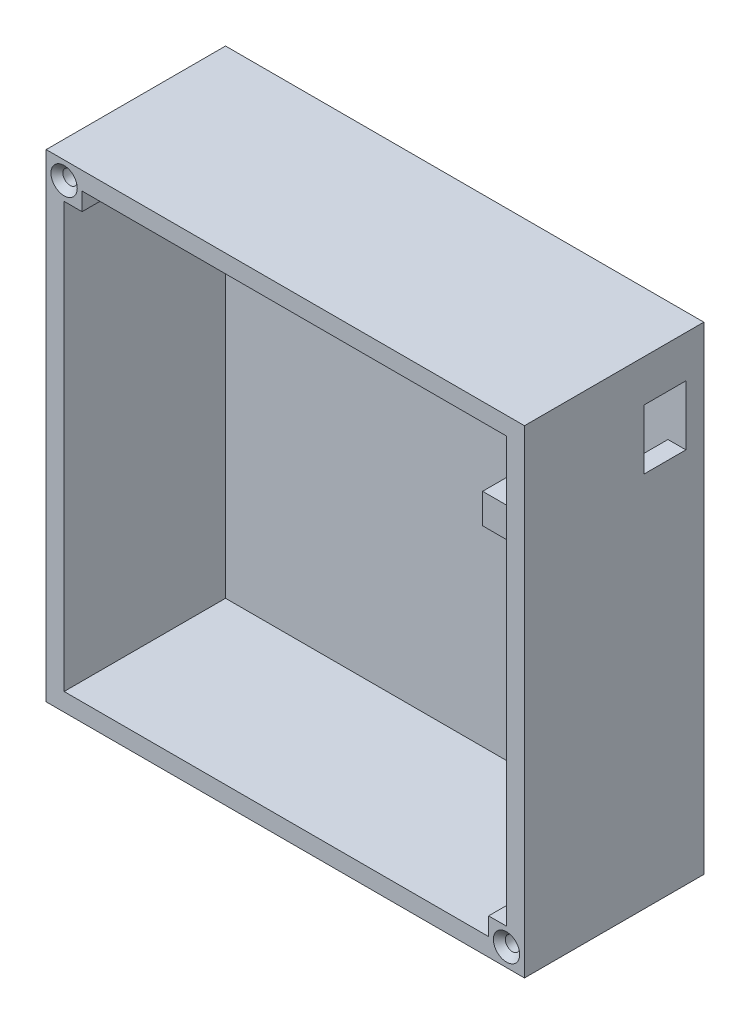
ISO-10303-21;
HEADER;
FILE_DESCRIPTION(('STEP AP214'),'2;1');
FILE_NAME('part.step','',(''),(''),'','','');
FILE_SCHEMA(('AUTOMOTIVE_DESIGN { 1 0 10303 214 1 1 1 1 }'));
ENDSEC;
DATA;
#1=APPLICATION_CONTEXT('core data for automotive mechanical design processes');
#2=APPLICATION_PROTOCOL_DEFINITION('international standard','automotive_design',2000,#1);
#3=PRODUCT_CONTEXT('',#1,'mechanical');
#4=PRODUCT('Part','Part','',(#3));
#5=PRODUCT_RELATED_PRODUCT_CATEGORY('part','',(#4));
#6=PRODUCT_DEFINITION_FORMATION('','',#4);
#7=PRODUCT_DEFINITION_CONTEXT('part definition',#1,'design');
#8=PRODUCT_DEFINITION('design','',#6,#7);
#9=PRODUCT_DEFINITION_SHAPE('','',#8);
#10=(LENGTH_UNIT() NAMED_UNIT(*) SI_UNIT(.MILLI.,.METRE.));
#11=(NAMED_UNIT(*) PLANE_ANGLE_UNIT() SI_UNIT($,.RADIAN.));
#12=(NAMED_UNIT(*) SI_UNIT($,.STERADIAN.) SOLID_ANGLE_UNIT());
#13=UNCERTAINTY_MEASURE_WITH_UNIT(LENGTH_MEASURE(1.E-05),#10,'distance_accuracy_value','');
#14=(GEOMETRIC_REPRESENTATION_CONTEXT(3) GLOBAL_UNCERTAINTY_ASSIGNED_CONTEXT((#13)) GLOBAL_UNIT_ASSIGNED_CONTEXT((#10,
#11,#12)) REPRESENTATION_CONTEXT('',''));
#15=CARTESIAN_POINT('',(0.,0.,0.));
#16=DIRECTION('',(0.,0.,1.));
#17=DIRECTION('',(1.,0.,0.));
#18=AXIS2_PLACEMENT_3D('',#15,#16,#17);
#19=CARTESIAN_POINT('',(0.,0.,3.));
#20=DIRECTION('',(0.,0.,1.));
#21=DIRECTION('',(1.,0.,0.));
#22=AXIS2_PLACEMENT_3D('',#19,#20,#21);
#23=PLANE('',#22);
#24=DIRECTION('',(0.,-1.,0.));
#25=VECTOR('',#24,1.);
#26=CARTESIAN_POINT('',(74.,3.,3.));
#27=LINE('',#26,#25);
#28=CARTESIAN_POINT('',(74.,6.,3.));
#29=VERTEX_POINT('',#28);
#30=CARTESIAN_POINT('',(74.,3.,3.));
#31=VERTEX_POINT('',#30);
#32=EDGE_CURVE('E310',#29,#31,#27,.T.);
#33=ORIENTED_EDGE('',*,*,#32,.F.);
#34=DIRECTION('',(-1.,0.,0.));
#35=VECTOR('',#34,1.);
#36=CARTESIAN_POINT('',(77.,6.,3.));
#37=LINE('',#36,#35);
#38=CARTESIAN_POINT('',(77.,5.99999999999999,3.));
#39=VERTEX_POINT('',#38);
#40=EDGE_CURVE('E305',#39,#29,#37,.T.);
#41=ORIENTED_EDGE('',*,*,#40,.F.);
#42=DIRECTION('',(0.,1.,0.));
#43=VECTOR('',#42,1.);
#44=CARTESIAN_POINT('',(77.,77.,3.));
#45=LINE('',#44,#43);
#46=CARTESIAN_POINT('',(77.,63.,3.));
#47=VERTEX_POINT('',#46);
#48=EDGE_CURVE('E404',#39,#47,#45,.T.);
#49=ORIENTED_EDGE('',*,*,#48,.T.);
#50=DIRECTION('',(1.,0.,0.));
#51=VECTOR('',#50,1.);
#52=CARTESIAN_POINT('',(77.,63.,3.));
#53=LINE('',#52,#51);
#54=CARTESIAN_POINT('',(80.,63.,3.));
#55=VERTEX_POINT('',#54);
#56=EDGE_CURVE('E383',#47,#55,#53,.T.);
#57=ORIENTED_EDGE('',*,*,#56,.T.);
#58=DIRECTION('',(0.,1.,0.));
#59=VECTOR('',#58,1.);
#60=CARTESIAN_POINT('',(80.,68.,3.));
#61=LINE('',#60,#59);
#62=CARTESIAN_POINT('',(80.,73.,3.));
#63=VERTEX_POINT('',#62);
#64=EDGE_CURVE('E360',#55,#63,#61,.T.);
#65=ORIENTED_EDGE('',*,*,#64,.T.);
#66=DIRECTION('',(1.,0.,0.));
#67=VECTOR('',#66,1.);
#68=CARTESIAN_POINT('',(77.,73.,3.));
#69=LINE('',#68,#67);
#70=CARTESIAN_POINT('',(77.,73.,3.));
#71=VERTEX_POINT('',#70);
#72=EDGE_CURVE('E368',#71,#63,#69,.T.);
#73=ORIENTED_EDGE('',*,*,#72,.F.);
#74=CARTESIAN_POINT('',(77.,77.,3.));
#75=VERTEX_POINT('',#74);
#76=EDGE_CURVE('E403',#71,#75,#45,.T.);
#77=ORIENTED_EDGE('',*,*,#76,.T.);
#78=DIRECTION('',(-1.,0.,0.));
#79=VECTOR('',#78,1.);
#80=CARTESIAN_POINT('',(3.,77.,3.));
#81=LINE('',#80,#79);
#82=CARTESIAN_POINT('',(6.,77.,3.));
#83=VERTEX_POINT('',#82);
#84=EDGE_CURVE('E407',#75,#83,#81,.T.);
#85=ORIENTED_EDGE('',*,*,#84,.T.);
#86=DIRECTION('',(0.,1.,0.));
#87=VECTOR('',#86,1.);
#88=CARTESIAN_POINT('',(6.,77.,3.));
#89=LINE('',#88,#87);
#90=CARTESIAN_POINT('',(6.,74.,3.));
#91=VERTEX_POINT('',#90);
#92=EDGE_CURVE('E336',#91,#83,#89,.T.);
#93=ORIENTED_EDGE('',*,*,#92,.F.);
#94=DIRECTION('',(1.,0.,0.));
#95=VECTOR('',#94,1.);
#96=CARTESIAN_POINT('',(3.,74.,3.));
#97=LINE('',#96,#95);
#98=CARTESIAN_POINT('',(3.,74.,3.));
#99=VERTEX_POINT('',#98);
#100=EDGE_CURVE('E331',#99,#91,#97,.T.);
#101=ORIENTED_EDGE('',*,*,#100,.F.);
#102=DIRECTION('',(0.,-1.,0.));
#103=VECTOR('',#102,1.);
#104=CARTESIAN_POINT('',(3.,77.,3.));
#105=LINE('',#104,#103);
#106=CARTESIAN_POINT('',(3.,3.,3.));
#107=VERTEX_POINT('',#106);
#108=EDGE_CURVE('E395',#99,#107,#105,.T.);
#109=ORIENTED_EDGE('',*,*,#108,.T.);
#110=DIRECTION('',(1.,0.,0.));
#111=VECTOR('',#110,1.);
#112=CARTESIAN_POINT('',(3.,3.,3.));
#113=LINE('',#112,#111);
#114=EDGE_CURVE('E398',#107,#31,#113,.T.);
#115=ORIENTED_EDGE('',*,*,#114,.T.);
#116=EDGE_LOOP('',(#33,#41,#49,#57,#65,#73,#77,#85,#93,#101,#109,#115));
#117=FACE_BOUND('',#116,.T.);
#118=DIRECTION('',(0.,-1.,0.));
#119=VECTOR('',#118,1.);
#120=CARTESIAN_POINT('',(47.538755387584,68.,3.));
#121=LINE('',#120,#119);
#122=CARTESIAN_POINT('',(47.538755387584,69.,3.));
#123=VERTEX_POINT('',#122);
#124=CARTESIAN_POINT('',(47.538755387584,67.,3.));
#125=VERTEX_POINT('',#124);
#126=EDGE_CURVE('E234',#123,#125,#121,.T.);
#127=ORIENTED_EDGE('',*,*,#126,.F.);
#128=DIRECTION('',(-1.,0.,0.));
#129=VECTOR('',#128,1.);
#130=CARTESIAN_POINT('',(50.,69.,3.));
#131=LINE('',#130,#129);
#132=CARTESIAN_POINT('',(50.,69.,3.));
#133=VERTEX_POINT('',#132);
#134=EDGE_CURVE('E229',#133,#123,#131,.T.);
#135=ORIENTED_EDGE('',*,*,#134,.F.);
#136=DIRECTION('',(0.,-1.,0.));
#137=VECTOR('',#136,1.);
#138=CARTESIAN_POINT('',(50.,68.,3.));
#139=LINE('',#138,#137);
#140=CARTESIAN_POINT('',(50.,67.,3.));
#141=VERTEX_POINT('',#140);
#142=EDGE_CURVE('E245',#133,#141,#139,.T.);
#143=ORIENTED_EDGE('',*,*,#142,.T.);
#144=DIRECTION('',(1.,0.,0.));
#145=VECTOR('',#144,1.);
#146=CARTESIAN_POINT('',(47.538755387584,67.,3.));
#147=LINE('',#146,#145);
#148=EDGE_CURVE('E260',#125,#141,#147,.T.);
#149=ORIENTED_EDGE('',*,*,#148,.F.);
#150=EDGE_LOOP('',(#127,#135,#143,#149));
#151=FACE_BOUND('',#150,.T.);
#152=DIRECTION('',(0.,-1.,0.));
#153=VECTOR('',#152,1.);
#154=CARTESIAN_POINT('',(65.,0.,3.));
#155=LINE('',#154,#153);
#156=CARTESIAN_POINT('',(65.,59.,3.));
#157=VERTEX_POINT('',#156);
#158=CARTESIAN_POINT('',(65.,54.,3.));
#159=VERTEX_POINT('',#158);
#160=EDGE_CURVE('E59',#157,#159,#155,.T.);
#161=ORIENTED_EDGE('',*,*,#160,.F.);
#162=DIRECTION('',(-1.,0.,0.));
#163=VECTOR('',#162,1.);
#164=CARTESIAN_POINT('',(0.,59.,3.));
#165=LINE('',#164,#163);
#166=CARTESIAN_POINT('',(70.,59.,3.));
#167=VERTEX_POINT('',#166);
#168=EDGE_CURVE('E227',#167,#157,#165,.T.);
#169=ORIENTED_EDGE('',*,*,#168,.F.);
#170=DIRECTION('',(0.,-1.,0.));
#171=VECTOR('',#170,1.);
#172=CARTESIAN_POINT('',(70.,0.,3.));
#173=LINE('',#172,#171);
#174=CARTESIAN_POINT('',(70.,54.,3.));
#175=VERTEX_POINT('',#174);
#176=EDGE_CURVE('E224',#167,#175,#173,.T.);
#177=ORIENTED_EDGE('',*,*,#176,.T.);
#178=DIRECTION('',(-1.,0.,0.));
#179=VECTOR('',#178,1.);
#180=CARTESIAN_POINT('',(0.,54.,3.));
#181=LINE('',#180,#179);
#182=EDGE_CURVE('E64',#175,#159,#181,.T.);
#183=ORIENTED_EDGE('',*,*,#182,.T.);
#184=EDGE_LOOP('',(#161,#169,#177,#183));
#185=FACE_BOUND('',#184,.T.);
#186=ADVANCED_FACE('F41',(#117,#151,#185),#23,.T.);
#187=CARTESIAN_POINT('',(77.,77.,3.));
#188=DIRECTION('',(1.,0.,0.));
#189=DIRECTION('',(0.,1.,0.));
#190=AXIS2_PLACEMENT_3D('',#187,#188,#189);
#191=PLANE('',#190);
#192=DIRECTION('',(0.,0.,-1.));
#193=VECTOR('',#192,1.);
#194=CARTESIAN_POINT('',(77.,6.,30.));
#195=LINE('',#194,#193);
#196=CARTESIAN_POINT('',(77.,5.99999999999999,30.));
#197=VERTEX_POINT('',#196);
#198=EDGE_CURVE('E327',#197,#39,#195,.T.);
#199=ORIENTED_EDGE('',*,*,#198,.F.);
#200=DIRECTION('',(0.,1.,0.));
#201=VECTOR('',#200,1.);
#202=CARTESIAN_POINT('',(77.,77.,30.));
#203=LINE('',#202,#201);
#204=CARTESIAN_POINT('',(77.,77.,30.));
#205=VERTEX_POINT('',#204);
#206=EDGE_CURVE('E417',#197,#205,#203,.T.);
#207=ORIENTED_EDGE('',*,*,#206,.T.);
#208=DIRECTION('',(0.,0.,1.));
#209=VECTOR('',#208,1.);
#210=CARTESIAN_POINT('',(77.,77.,3.));
#211=LINE('',#210,#209);
#212=EDGE_CURVE('E423',#75,#205,#211,.T.);
#213=ORIENTED_EDGE('',*,*,#212,.F.);
#214=ORIENTED_EDGE('',*,*,#76,.F.);
#215=DIRECTION('',(0.,0.,1.));
#216=VECTOR('',#215,1.);
#217=CARTESIAN_POINT('',(77.,73.,3.));
#218=LINE('',#217,#216);
#219=CARTESIAN_POINT('',(77.,73.,10.));
#220=VERTEX_POINT('',#219);
#221=EDGE_CURVE('E355',#71,#220,#218,.T.);
#222=ORIENTED_EDGE('',*,*,#221,.T.);
#223=DIRECTION('',(0.,-1.,0.));
#224=VECTOR('',#223,1.);
#225=CARTESIAN_POINT('',(77.,68.,10.));
#226=LINE('',#225,#224);
#227=CARTESIAN_POINT('',(77.,63.,10.));
#228=VERTEX_POINT('',#227);
#229=EDGE_CURVE('E359',#220,#228,#226,.T.);
#230=ORIENTED_EDGE('',*,*,#229,.T.);
#231=DIRECTION('',(0.,0.,-1.));
#232=VECTOR('',#231,1.);
#233=CARTESIAN_POINT('',(77.,63.,3.));
#234=LINE('',#233,#232);
#235=EDGE_CURVE('E364',#228,#47,#234,.T.);
#236=ORIENTED_EDGE('',*,*,#235,.T.);
#237=ORIENTED_EDGE('',*,*,#48,.F.);
#238=EDGE_LOOP('',(#199,#207,#213,#214,#222,#230,#236,#237));
#239=FACE_BOUND('',#238,.T.);
#240=ADVANCED_FACE('F500',(#239),#191,.F.);
#241=CARTESIAN_POINT('',(3.,3.,3.));
#242=DIRECTION('',(0.,-1.,0.));
#243=DIRECTION('',(0.,0.,-1.));
#244=AXIS2_PLACEMENT_3D('',#241,#242,#243);
#245=PLANE('',#244);
#246=DIRECTION('',(0.,0.,-1.));
#247=VECTOR('',#246,1.);
#248=CARTESIAN_POINT('',(74.,3.,30.));
#249=LINE('',#248,#247);
#250=CARTESIAN_POINT('',(74.,3.,30.));
#251=VERTEX_POINT('',#250);
#252=EDGE_CURVE('E314',#251,#31,#249,.T.);
#253=ORIENTED_EDGE('',*,*,#252,.T.);
#254=ORIENTED_EDGE('',*,*,#114,.F.);
#255=DIRECTION('',(0.,0.,1.));
#256=VECTOR('',#255,1.);
#257=CARTESIAN_POINT('',(3.,3.,3.));
#258=LINE('',#257,#256);
#259=CARTESIAN_POINT('',(3.,3.,30.));
#260=VERTEX_POINT('',#259);
#261=EDGE_CURVE('E411',#107,#260,#258,.T.);
#262=ORIENTED_EDGE('',*,*,#261,.T.);
#263=DIRECTION('',(1.,0.,0.));
#264=VECTOR('',#263,1.);
#265=CARTESIAN_POINT('',(3.,3.,30.));
#266=LINE('',#265,#264);
#267=EDGE_CURVE('E414',#260,#251,#266,.T.);
#268=ORIENTED_EDGE('',*,*,#267,.T.);
#269=EDGE_LOOP('',(#253,#254,#262,#268));
#270=FACE_BOUND('',#269,.T.);
#271=ADVANCED_FACE('F507',(#270),#245,.F.);
#272=CARTESIAN_POINT('',(3.,77.,3.));
#273=DIRECTION('',(-1.,0.,0.));
#274=DIRECTION('',(0.,-1.,0.));
#275=AXIS2_PLACEMENT_3D('',#272,#273,#274);
#276=PLANE('',#275);
#277=DIRECTION('',(0.,0.,-1.));
#278=VECTOR('',#277,1.);
#279=CARTESIAN_POINT('',(3.,74.,30.));
#280=LINE('',#279,#278);
#281=CARTESIAN_POINT('',(3.,74.,30.));
#282=VERTEX_POINT('',#281);
#283=EDGE_CURVE('E351',#282,#99,#280,.T.);
#284=ORIENTED_EDGE('',*,*,#283,.F.);
#285=DIRECTION('',(0.,-1.,0.));
#286=VECTOR('',#285,1.);
#287=CARTESIAN_POINT('',(3.,77.,30.));
#288=LINE('',#287,#286);
#289=EDGE_CURVE('E386',#282,#260,#288,.T.);
#290=ORIENTED_EDGE('',*,*,#289,.T.);
#291=ORIENTED_EDGE('',*,*,#261,.F.);
#292=ORIENTED_EDGE('',*,*,#108,.F.);
#293=EDGE_LOOP('',(#284,#290,#291,#292));
#294=FACE_BOUND('',#293,.T.);
#295=ADVANCED_FACE('F517',(#294),#276,.F.);
#296=CARTESIAN_POINT('',(3.,77.,3.));
#297=DIRECTION('',(0.,1.,0.));
#298=DIRECTION('',(0.,0.,1.));
#299=AXIS2_PLACEMENT_3D('',#296,#297,#298);
#300=PLANE('',#299);
#301=DIRECTION('',(0.,0.,-1.));
#302=VECTOR('',#301,1.);
#303=CARTESIAN_POINT('',(6.,77.,30.));
#304=LINE('',#303,#302);
#305=CARTESIAN_POINT('',(6.,77.,30.));
#306=VERTEX_POINT('',#305);
#307=EDGE_CURVE('E339',#306,#83,#304,.T.);
#308=ORIENTED_EDGE('',*,*,#307,.T.);
#309=ORIENTED_EDGE('',*,*,#84,.F.);
#310=ORIENTED_EDGE('',*,*,#212,.T.);
#311=DIRECTION('',(-1.,0.,0.));
#312=VECTOR('',#311,1.);
#313=CARTESIAN_POINT('',(3.,77.,30.));
#314=LINE('',#313,#312);
#315=EDGE_CURVE('E399',#205,#306,#314,.T.);
#316=ORIENTED_EDGE('',*,*,#315,.T.);
#317=EDGE_LOOP('',(#308,#309,#310,#316));
#318=FACE_BOUND('',#317,.T.);
#319=ADVANCED_FACE('F515',(#318),#300,.F.);
#320=CARTESIAN_POINT('',(0.,0.,30.));
#321=DIRECTION('',(-1.,0.,0.));
#322=DIRECTION('',(0.,0.,1.));
#323=AXIS2_PLACEMENT_3D('',#320,#321,#322);
#324=PLANE('',#323);
#325=DIRECTION('',(0.,1.,0.));
#326=VECTOR('',#325,1.);
#327=CARTESIAN_POINT('',(0.,0.,0.));
#328=LINE('',#327,#326);
#329=CARTESIAN_POINT('',(0.,0.,0.));
#330=VERTEX_POINT('',#329);
#331=CARTESIAN_POINT('',(0.,80.,0.));
#332=VERTEX_POINT('',#331);
#333=EDGE_CURVE('E427',#330,#332,#328,.T.);
#334=ORIENTED_EDGE('',*,*,#333,.F.);
#335=DIRECTION('',(0.,0.,-1.));
#336=VECTOR('',#335,1.);
#337=CARTESIAN_POINT('',(0.,0.,30.));
#338=LINE('',#337,#336);
#339=CARTESIAN_POINT('',(0.,0.,30.));
#340=VERTEX_POINT('',#339);
#341=EDGE_CURVE('E11',#340,#330,#338,.T.);
#342=ORIENTED_EDGE('',*,*,#341,.F.);
#343=DIRECTION('',(0.,1.,0.));
#344=VECTOR('',#343,1.);
#345=CARTESIAN_POINT('',(0.,0.,30.));
#346=LINE('',#345,#344);
#347=CARTESIAN_POINT('',(0.,80.,30.));
#348=VERTEX_POINT('',#347);
#349=EDGE_CURVE('E431',#340,#348,#346,.T.);
#350=ORIENTED_EDGE('',*,*,#349,.T.);
#351=DIRECTION('',(0.,0.,-1.));
#352=VECTOR('',#351,1.);
#353=CARTESIAN_POINT('',(0.,80.,30.));
#354=LINE('',#353,#352);
#355=EDGE_CURVE('E45',#348,#332,#354,.T.);
#356=ORIENTED_EDGE('',*,*,#355,.T.);
#357=EDGE_LOOP('',(#334,#342,#350,#356));
#358=FACE_BOUND('',#357,.T.);
#359=ADVANCED_FACE('F43',(#358),#324,.T.);
#360=CARTESIAN_POINT('',(0.,0.,30.));
#361=DIRECTION('',(0.,1.,0.));
#362=DIRECTION('',(0.,0.,1.));
#363=AXIS2_PLACEMENT_3D('',#360,#361,#362);
#364=PLANE('',#363);
#365=DIRECTION('',(1.,0.,0.));
#366=VECTOR('',#365,1.);
#367=CARTESIAN_POINT('',(0.,0.,0.));
#368=LINE('',#367,#366);
#369=CARTESIAN_POINT('',(80.,0.,0.));
#370=VERTEX_POINT('',#369);
#371=EDGE_CURVE('E436',#330,#370,#368,.T.);
#372=ORIENTED_EDGE('',*,*,#371,.T.);
#373=DIRECTION('',(0.,0.,-1.));
#374=VECTOR('',#373,1.);
#375=CARTESIAN_POINT('',(80.,0.,30.));
#376=LINE('',#375,#374);
#377=CARTESIAN_POINT('',(80.,0.,30.));
#378=VERTEX_POINT('',#377);
#379=EDGE_CURVE('E51',#378,#370,#376,.T.);
#380=ORIENTED_EDGE('',*,*,#379,.F.);
#381=DIRECTION('',(1.,0.,0.));
#382=VECTOR('',#381,1.);
#383=CARTESIAN_POINT('',(0.,0.,30.));
#384=LINE('',#383,#382);
#385=EDGE_CURVE('E443',#340,#378,#384,.T.);
#386=ORIENTED_EDGE('',*,*,#385,.F.);
#387=ORIENTED_EDGE('',*,*,#341,.T.);
#388=EDGE_LOOP('',(#372,#380,#386,#387));
#389=FACE_BOUND('',#388,.T.);
#390=ADVANCED_FACE('F478',(#389),#364,.F.);
#391=CARTESIAN_POINT('',(80.,0.,30.));
#392=DIRECTION('',(-1.,0.,0.));
#393=DIRECTION('',(0.,0.,1.));
#394=AXIS2_PLACEMENT_3D('',#391,#392,#393);
#395=PLANE('',#394);
#396=DIRECTION('',(0.,0.,1.));
#397=VECTOR('',#396,1.);
#398=CARTESIAN_POINT('',(80.,73.,3.));
#399=LINE('',#398,#397);
#400=CARTESIAN_POINT('',(80.,73.,10.));
#401=VERTEX_POINT('',#400);
#402=EDGE_CURVE('E354',#63,#401,#399,.T.);
#403=ORIENTED_EDGE('',*,*,#402,.F.);
#404=ORIENTED_EDGE('',*,*,#64,.F.);
#405=DIRECTION('',(0.,0.,-1.));
#406=VECTOR('',#405,1.);
#407=CARTESIAN_POINT('',(80.,63.,3.));
#408=LINE('',#407,#406);
#409=CARTESIAN_POINT('',(80.,63.,10.));
#410=VERTEX_POINT('',#409);
#411=EDGE_CURVE('E376',#410,#55,#408,.T.);
#412=ORIENTED_EDGE('',*,*,#411,.F.);
#413=DIRECTION('',(0.,-1.,0.));
#414=VECTOR('',#413,1.);
#415=CARTESIAN_POINT('',(80.,68.,10.));
#416=LINE('',#415,#414);
#417=EDGE_CURVE('E372',#401,#410,#416,.T.);
#418=ORIENTED_EDGE('',*,*,#417,.F.);
#419=EDGE_LOOP('',(#403,#404,#412,#418));
#420=FACE_BOUND('',#419,.T.);
#421=DIRECTION('',(0.,1.,0.));
#422=VECTOR('',#421,1.);
#423=CARTESIAN_POINT('',(80.,0.,0.));
#424=LINE('',#423,#422);
#425=CARTESIAN_POINT('',(80.,80.,0.));
#426=VERTEX_POINT('',#425);
#427=EDGE_CURVE('E453',#370,#426,#424,.T.);
#428=ORIENTED_EDGE('',*,*,#427,.T.);
#429=DIRECTION('',(0.,0.,-1.));
#430=VECTOR('',#429,1.);
#431=CARTESIAN_POINT('',(80.,80.,30.));
#432=LINE('',#431,#430);
#433=CARTESIAN_POINT('',(80.,80.,30.));
#434=VERTEX_POINT('',#433);
#435=EDGE_CURVE('E461',#434,#426,#432,.T.);
#436=ORIENTED_EDGE('',*,*,#435,.F.);
#437=DIRECTION('',(0.,1.,0.));
#438=VECTOR('',#437,1.);
#439=CARTESIAN_POINT('',(80.,0.,30.));
#440=LINE('',#439,#438);
#441=EDGE_CURVE('E440',#378,#434,#440,.T.);
#442=ORIENTED_EDGE('',*,*,#441,.F.);
#443=ORIENTED_EDGE('',*,*,#379,.T.);
#444=EDGE_LOOP('',(#428,#436,#442,#443));
#445=FACE_BOUND('',#444,.T.);
#446=ADVANCED_FACE('F482',(#420,#445),#395,.F.);
#447=CARTESIAN_POINT('',(0.,80.,30.));
#448=DIRECTION('',(0.,1.,0.));
#449=DIRECTION('',(0.,0.,1.));
#450=AXIS2_PLACEMENT_3D('',#447,#448,#449);
#451=PLANE('',#450);
#452=DIRECTION('',(1.,0.,0.));
#453=VECTOR('',#452,1.);
#454=CARTESIAN_POINT('',(0.,80.,0.));
#455=LINE('',#454,#453);
#456=EDGE_CURVE('E449',#332,#426,#455,.T.);
#457=ORIENTED_EDGE('',*,*,#456,.F.);
#458=ORIENTED_EDGE('',*,*,#355,.F.);
#459=DIRECTION('',(1.,0.,0.));
#460=VECTOR('',#459,1.);
#461=CARTESIAN_POINT('',(0.,80.,30.));
#462=LINE('',#461,#460);
#463=EDGE_CURVE('E435',#348,#434,#462,.T.);
#464=ORIENTED_EDGE('',*,*,#463,.T.);
#465=ORIENTED_EDGE('',*,*,#435,.T.);
#466=EDGE_LOOP('',(#457,#458,#464,#465));
#467=FACE_BOUND('',#466,.T.);
#468=ADVANCED_FACE('F471',(#467),#451,.T.);
#469=CARTESIAN_POINT('',(0.,0.,30.));
#470=DIRECTION('',(0.,0.,-1.));
#471=DIRECTION('',(-1.,0.,0.));
#472=AXIS2_PLACEMENT_3D('',#469,#470,#471);
#473=PLANE('',#472);
#474=CARTESIAN_POINT('',(3.,77.,30.));
#475=DIRECTION('',(0.,0.,1.));
#476=DIRECTION('',(1.,0.,0.));
#477=AXIS2_PLACEMENT_3D('',#474,#475,#476);
#478=CIRCLE('',#477,2.2);
#479=CARTESIAN_POINT('',(5.2,77.,30.));
#480=VERTEX_POINT('',#479);
#481=EDGE_CURVE('E281',#480,#480,#478,.T.);
#482=ORIENTED_EDGE('',*,*,#481,.F.);
#483=EDGE_LOOP('',(#482));
#484=FACE_BOUND('',#483,.T.);
#485=CARTESIAN_POINT('',(77.,3.,30.));
#486=DIRECTION('',(0.,0.,1.));
#487=DIRECTION('',(1.,0.,0.));
#488=AXIS2_PLACEMENT_3D('',#485,#486,#487);
#489=CIRCLE('',#488,2.19999999999999);
#490=CARTESIAN_POINT('',(79.2,3.,30.));
#491=VERTEX_POINT('',#490);
#492=EDGE_CURVE('E293',#491,#491,#489,.T.);
#493=ORIENTED_EDGE('',*,*,#492,.F.);
#494=EDGE_LOOP('',(#493));
#495=FACE_BOUND('',#494,.T.);
#496=ORIENTED_EDGE('',*,*,#206,.F.);
#497=DIRECTION('',(-1.,0.,0.));
#498=VECTOR('',#497,1.);
#499=CARTESIAN_POINT('',(77.,6.,30.));
#500=LINE('',#499,#498);
#501=CARTESIAN_POINT('',(74.,6.,30.));
#502=VERTEX_POINT('',#501);
#503=EDGE_CURVE('E306',#197,#502,#500,.T.);
#504=ORIENTED_EDGE('',*,*,#503,.T.);
#505=DIRECTION('',(0.,-1.,0.));
#506=VECTOR('',#505,1.);
#507=CARTESIAN_POINT('',(74.,3.,30.));
#508=LINE('',#507,#506);
#509=EDGE_CURVE('E309',#502,#251,#508,.T.);
#510=ORIENTED_EDGE('',*,*,#509,.T.);
#511=ORIENTED_EDGE('',*,*,#267,.F.);
#512=ORIENTED_EDGE('',*,*,#289,.F.);
#513=DIRECTION('',(1.,0.,0.));
#514=VECTOR('',#513,1.);
#515=CARTESIAN_POINT('',(3.,74.,30.));
#516=LINE('',#515,#514);
#517=CARTESIAN_POINT('',(6.,74.,30.));
#518=VERTEX_POINT('',#517);
#519=EDGE_CURVE('E332',#282,#518,#516,.T.);
#520=ORIENTED_EDGE('',*,*,#519,.T.);
#521=DIRECTION('',(0.,1.,0.));
#522=VECTOR('',#521,1.);
#523=CARTESIAN_POINT('',(6.,77.,30.));
#524=LINE('',#523,#522);
#525=EDGE_CURVE('E335',#518,#306,#524,.T.);
#526=ORIENTED_EDGE('',*,*,#525,.T.);
#527=ORIENTED_EDGE('',*,*,#315,.F.);
#528=EDGE_LOOP('',(#496,#504,#510,#511,#512,#520,#526,#527));
#529=FACE_BOUND('',#528,.T.);
#530=ORIENTED_EDGE('',*,*,#349,.F.);
#531=ORIENTED_EDGE('',*,*,#385,.T.);
#532=ORIENTED_EDGE('',*,*,#441,.T.);
#533=ORIENTED_EDGE('',*,*,#463,.F.);
#534=EDGE_LOOP('',(#530,#531,#532,#533));
#535=FACE_BOUND('',#534,.T.);
#536=ADVANCED_FACE('F484',(#484,#495,#529,#535),#473,.F.);
#537=CARTESIAN_POINT('',(0.,0.,0.));
#538=DIRECTION('',(0.,0.,-1.));
#539=DIRECTION('',(-1.,0.,0.));
#540=AXIS2_PLACEMENT_3D('',#537,#538,#539);
#541=PLANE('',#540);
#542=CARTESIAN_POINT('',(3.,77.,0.));
#543=DIRECTION('',(0.,0.,1.));
#544=DIRECTION('',(1.,0.,0.));
#545=AXIS2_PLACEMENT_3D('',#542,#543,#544);
#546=CIRCLE('',#545,1.2);
#547=CARTESIAN_POINT('',(4.2,77.,0.));
#548=VERTEX_POINT('',#547);
#549=EDGE_CURVE('E289',#548,#548,#546,.T.);
#550=ORIENTED_EDGE('',*,*,#549,.T.);
#551=EDGE_LOOP('',(#550));
#552=FACE_BOUND('',#551,.T.);
#553=CARTESIAN_POINT('',(77.,3.,0.));
#554=DIRECTION('',(0.,0.,1.));
#555=DIRECTION('',(1.,0.,0.));
#556=AXIS2_PLACEMENT_3D('',#553,#554,#555);
#557=CIRCLE('',#556,1.20000000000001);
#558=CARTESIAN_POINT('',(78.2,3.,0.));
#559=VERTEX_POINT('',#558);
#560=EDGE_CURVE('E301',#559,#559,#557,.T.);
#561=ORIENTED_EDGE('',*,*,#560,.T.);
#562=EDGE_LOOP('',(#561));
#563=FACE_BOUND('',#562,.T.);
#564=ORIENTED_EDGE('',*,*,#333,.T.);
#565=ORIENTED_EDGE('',*,*,#456,.T.);
#566=ORIENTED_EDGE('',*,*,#427,.F.);
#567=ORIENTED_EDGE('',*,*,#371,.F.);
#568=EDGE_LOOP('',(#564,#565,#566,#567));
#569=FACE_BOUND('',#568,.T.);
#570=ADVANCED_FACE('F475',(#552,#563,#569),#541,.T.);
#571=CARTESIAN_POINT('',(77.,63.,3.));
#572=DIRECTION('',(0.,-1.,0.));
#573=DIRECTION('',(0.,0.,-1.));
#574=AXIS2_PLACEMENT_3D('',#571,#572,#573);
#575=PLANE('',#574);
#576=ORIENTED_EDGE('',*,*,#411,.T.);
#577=ORIENTED_EDGE('',*,*,#56,.F.);
#578=ORIENTED_EDGE('',*,*,#235,.F.);
#579=DIRECTION('',(1.,0.,0.));
#580=VECTOR('',#579,1.);
#581=CARTESIAN_POINT('',(77.,63.,10.));
#582=LINE('',#581,#580);
#583=EDGE_CURVE('E387',#228,#410,#582,.T.);
#584=ORIENTED_EDGE('',*,*,#583,.T.);
#585=EDGE_LOOP('',(#576,#577,#578,#584));
#586=FACE_BOUND('',#585,.T.);
#587=ADVANCED_FACE('F493',(#586),#575,.F.);
#588=CARTESIAN_POINT('',(77.,68.,10.));
#589=DIRECTION('',(0.,0.,1.));
#590=DIRECTION('',(0.,-1.,0.));
#591=AXIS2_PLACEMENT_3D('',#588,#589,#590);
#592=PLANE('',#591);
#593=ORIENTED_EDGE('',*,*,#417,.T.);
#594=ORIENTED_EDGE('',*,*,#583,.F.);
#595=ORIENTED_EDGE('',*,*,#229,.F.);
#596=DIRECTION('',(1.,0.,0.));
#597=VECTOR('',#596,1.);
#598=CARTESIAN_POINT('',(77.,73.,10.));
#599=LINE('',#598,#597);
#600=EDGE_CURVE('E390',#220,#401,#599,.T.);
#601=ORIENTED_EDGE('',*,*,#600,.T.);
#602=EDGE_LOOP('',(#593,#594,#595,#601));
#603=FACE_BOUND('',#602,.T.);
#604=ADVANCED_FACE('F576',(#603),#592,.F.);
#605=CARTESIAN_POINT('',(77.,73.,3.));
#606=DIRECTION('',(0.,1.,0.));
#607=DIRECTION('',(0.,0.,1.));
#608=AXIS2_PLACEMENT_3D('',#605,#606,#607);
#609=PLANE('',#608);
#610=ORIENTED_EDGE('',*,*,#402,.T.);
#611=ORIENTED_EDGE('',*,*,#600,.F.);
#612=ORIENTED_EDGE('',*,*,#221,.F.);
#613=ORIENTED_EDGE('',*,*,#72,.T.);
#614=EDGE_LOOP('',(#610,#611,#612,#613));
#615=FACE_BOUND('',#614,.T.);
#616=ADVANCED_FACE('F513',(#615),#609,.F.);
#617=CARTESIAN_POINT('',(3.,74.,30.));
#618=DIRECTION('',(0.,1.,0.));
#619=DIRECTION('',(0.,0.,1.));
#620=AXIS2_PLACEMENT_3D('',#617,#618,#619);
#621=PLANE('',#620);
#622=ORIENTED_EDGE('',*,*,#100,.T.);
#623=DIRECTION('',(0.,0.,-1.));
#624=VECTOR('',#623,1.);
#625=CARTESIAN_POINT('',(6.,74.,30.));
#626=LINE('',#625,#624);
#627=EDGE_CURVE('E348',#518,#91,#626,.T.);
#628=ORIENTED_EDGE('',*,*,#627,.F.);
#629=ORIENTED_EDGE('',*,*,#519,.F.);
#630=ORIENTED_EDGE('',*,*,#283,.T.);
#631=EDGE_LOOP('',(#622,#628,#629,#630));
#632=FACE_BOUND('',#631,.T.);
#633=ADVANCED_FACE('F568',(#632),#621,.F.);
#634=CARTESIAN_POINT('',(6.,77.,30.));
#635=DIRECTION('',(-1.,0.,0.));
#636=DIRECTION('',(0.,0.,1.));
#637=AXIS2_PLACEMENT_3D('',#634,#635,#636);
#638=PLANE('',#637);
#639=ORIENTED_EDGE('',*,*,#92,.T.);
#640=ORIENTED_EDGE('',*,*,#307,.F.);
#641=ORIENTED_EDGE('',*,*,#525,.F.);
#642=ORIENTED_EDGE('',*,*,#627,.T.);
#643=EDGE_LOOP('',(#639,#640,#641,#642));
#644=FACE_BOUND('',#643,.T.);
#645=ADVANCED_FACE('F567',(#644),#638,.F.);
#646=CARTESIAN_POINT('',(77.,6.,30.));
#647=DIRECTION('',(0.,-1.,0.));
#648=DIRECTION('',(1.,0.,0.));
#649=AXIS2_PLACEMENT_3D('',#646,#647,#648);
#650=PLANE('',#649);
#651=ORIENTED_EDGE('',*,*,#40,.T.);
#652=DIRECTION('',(0.,0.,-1.));
#653=VECTOR('',#652,1.);
#654=CARTESIAN_POINT('',(74.,6.,30.));
#655=LINE('',#654,#653);
#656=EDGE_CURVE('E323',#502,#29,#655,.T.);
#657=ORIENTED_EDGE('',*,*,#656,.F.);
#658=ORIENTED_EDGE('',*,*,#503,.F.);
#659=ORIENTED_EDGE('',*,*,#198,.T.);
#660=EDGE_LOOP('',(#651,#657,#658,#659));
#661=FACE_BOUND('',#660,.T.);
#662=ADVANCED_FACE('F545',(#661),#650,.F.);
#663=CARTESIAN_POINT('',(74.,3.,30.));
#664=DIRECTION('',(1.,0.,0.));
#665=DIRECTION('',(0.,0.,-1.));
#666=AXIS2_PLACEMENT_3D('',#663,#664,#665);
#667=PLANE('',#666);
#668=ORIENTED_EDGE('',*,*,#32,.T.);
#669=ORIENTED_EDGE('',*,*,#252,.F.);
#670=ORIENTED_EDGE('',*,*,#509,.F.);
#671=ORIENTED_EDGE('',*,*,#656,.T.);
#672=EDGE_LOOP('',(#668,#669,#670,#671));
#673=FACE_BOUND('',#672,.T.);
#674=ADVANCED_FACE('F541',(#673),#667,.F.);
#675=CARTESIAN_POINT('',(77.,3.,30.));
#676=DIRECTION('',(0.,0.,1.));
#677=DIRECTION('',(1.,0.,0.));
#678=AXIS2_PLACEMENT_3D('',#675,#676,#677);
#679=CYLINDRICAL_SURFACE('',#678,1.20000000000001);
#680=ORIENTED_EDGE('',*,*,#560,.F.);
#681=EDGE_LOOP('',(#680));
#682=FACE_BOUND('',#681,.T.);
#683=CARTESIAN_POINT('',(77.,3.,29.));
#684=DIRECTION('',(0.,0.,1.));
#685=DIRECTION('',(1.,0.,0.));
#686=AXIS2_PLACEMENT_3D('',#683,#684,#685);
#687=CIRCLE('',#686,1.20000000000001);
#688=CARTESIAN_POINT('',(78.2,3.,29.));
#689=VERTEX_POINT('',#688);
#690=EDGE_CURVE('E297',#689,#689,#687,.T.);
#691=ORIENTED_EDGE('',*,*,#690,.T.);
#692=EDGE_LOOP('',(#691));
#693=FACE_BOUND('',#692,.T.);
#694=ADVANCED_FACE('F648',(#682,#693),#679,.F.);
#695=CARTESIAN_POINT('',(77.,3.,30.));
#696=DIRECTION('',(0.,0.,1.));
#697=DIRECTION('',(1.,0.,0.));
#698=AXIS2_PLACEMENT_3D('',#695,#696,#697);
#699=CONICAL_SURFACE('',#698,2.19999999999999,0.785398163397442);
#700=ORIENTED_EDGE('',*,*,#690,.F.);
#701=EDGE_LOOP('',(#700));
#702=FACE_BOUND('',#701,.T.);
#703=ORIENTED_EDGE('',*,*,#492,.T.);
#704=EDGE_LOOP('',(#703));
#705=FACE_BOUND('',#704,.T.);
#706=ADVANCED_FACE('F661',(#702,#705),#699,.F.);
#707=CARTESIAN_POINT('',(3.,77.,30.));
#708=DIRECTION('',(0.,0.,1.));
#709=DIRECTION('',(1.,0.,0.));
#710=AXIS2_PLACEMENT_3D('',#707,#708,#709);
#711=CYLINDRICAL_SURFACE('',#710,1.2);
#712=ORIENTED_EDGE('',*,*,#549,.F.);
#713=EDGE_LOOP('',(#712));
#714=FACE_BOUND('',#713,.T.);
#715=CARTESIAN_POINT('',(3.,77.,29.));
#716=DIRECTION('',(0.,0.,1.));
#717=DIRECTION('',(1.,0.,0.));
#718=AXIS2_PLACEMENT_3D('',#715,#716,#717);
#719=CIRCLE('',#718,1.2);
#720=CARTESIAN_POINT('',(4.2,77.,29.));
#721=VERTEX_POINT('',#720);
#722=EDGE_CURVE('E285',#721,#721,#719,.T.);
#723=ORIENTED_EDGE('',*,*,#722,.T.);
#724=EDGE_LOOP('',(#723));
#725=FACE_BOUND('',#724,.T.);
#726=ADVANCED_FACE('F671',(#714,#725),#711,.F.);
#727=CARTESIAN_POINT('',(3.,77.,30.));
#728=DIRECTION('',(0.,0.,1.));
#729=DIRECTION('',(1.,0.,0.));
#730=AXIS2_PLACEMENT_3D('',#727,#728,#729);
#731=CONICAL_SURFACE('',#730,2.2,0.785398163397448);
#732=ORIENTED_EDGE('',*,*,#722,.F.);
#733=EDGE_LOOP('',(#732));
#734=FACE_BOUND('',#733,.T.);
#735=ORIENTED_EDGE('',*,*,#481,.T.);
#736=EDGE_LOOP('',(#735));
#737=FACE_BOUND('',#736,.T.);
#738=ADVANCED_FACE('F681',(#734,#737),#731,.F.);
#739=CARTESIAN_POINT('',(50.,69.,6.));
#740=DIRECTION('',(0.,-1.,0.));
#741=DIRECTION('',(0.,0.,-1.));
#742=AXIS2_PLACEMENT_3D('',#739,#740,#741);
#743=PLANE('',#742);
#744=ORIENTED_EDGE('',*,*,#134,.T.);
#745=DIRECTION('',(0.,0.,-1.));
#746=VECTOR('',#745,1.);
#747=CARTESIAN_POINT('',(47.538755387584,69.,6.));
#748=LINE('',#747,#746);
#749=CARTESIAN_POINT('',(47.538755387584,69.,6.));
#750=VERTEX_POINT('',#749);
#751=EDGE_CURVE('E273',#750,#123,#748,.T.);
#752=ORIENTED_EDGE('',*,*,#751,.F.);
#753=DIRECTION('',(-1.,0.,0.));
#754=VECTOR('',#753,1.);
#755=CARTESIAN_POINT('',(50.,69.,6.));
#756=LINE('',#755,#754);
#757=CARTESIAN_POINT('',(50.,69.,6.));
#758=VERTEX_POINT('',#757);
#759=EDGE_CURVE('E244',#758,#750,#756,.T.);
#760=ORIENTED_EDGE('',*,*,#759,.F.);
#761=DIRECTION('',(0.,0.,-1.));
#762=VECTOR('',#761,1.);
#763=CARTESIAN_POINT('',(50.,69.,6.));
#764=LINE('',#763,#762);
#765=EDGE_CURVE('E277',#758,#133,#764,.T.);
#766=ORIENTED_EDGE('',*,*,#765,.T.);
#767=EDGE_LOOP('',(#744,#752,#760,#766));
#768=FACE_BOUND('',#767,.T.);
#769=ADVANCED_FACE('F691',(#768),#743,.F.);
#770=CARTESIAN_POINT('',(47.538755387584,68.,6.));
#771=DIRECTION('',(1.,0.,0.));
#772=DIRECTION('',(0.,0.,-1.));
#773=AXIS2_PLACEMENT_3D('',#770,#771,#772);
#774=PLANE('',#773);
#775=ORIENTED_EDGE('',*,*,#126,.T.);
#776=DIRECTION('',(0.,0.,-1.));
#777=VECTOR('',#776,1.);
#778=CARTESIAN_POINT('',(47.538755387584,67.,6.));
#779=LINE('',#778,#777);
#780=CARTESIAN_POINT('',(47.538755387584,67.,6.));
#781=VERTEX_POINT('',#780);
#782=EDGE_CURVE('E269',#781,#125,#779,.T.);
#783=ORIENTED_EDGE('',*,*,#782,.F.);
#784=DIRECTION('',(0.,1.,0.));
#785=VECTOR('',#784,1.);
#786=CARTESIAN_POINT('',(47.538755387584,68.,6.));
#787=LINE('',#786,#785);
#788=EDGE_CURVE('E248',#781,#750,#787,.T.);
#789=ORIENTED_EDGE('',*,*,#788,.T.);
#790=ORIENTED_EDGE('',*,*,#751,.T.);
#791=EDGE_LOOP('',(#775,#783,#789,#790));
#792=FACE_BOUND('',#791,.T.);
#793=ADVANCED_FACE('F701',(#792),#774,.F.);
#794=CARTESIAN_POINT('',(47.538755387584,67.,6.));
#795=DIRECTION('',(0.,1.,0.));
#796=DIRECTION('',(0.,0.,1.));
#797=AXIS2_PLACEMENT_3D('',#794,#795,#796);
#798=PLANE('',#797);
#799=ORIENTED_EDGE('',*,*,#148,.T.);
#800=DIRECTION('',(0.,0.,-1.));
#801=VECTOR('',#800,1.);
#802=CARTESIAN_POINT('',(50.,67.,6.));
#803=LINE('',#802,#801);
#804=CARTESIAN_POINT('',(50.,67.,6.));
#805=VERTEX_POINT('',#804);
#806=EDGE_CURVE('E255',#805,#141,#803,.T.);
#807=ORIENTED_EDGE('',*,*,#806,.F.);
#808=DIRECTION('',(1.,0.,0.));
#809=VECTOR('',#808,1.);
#810=CARTESIAN_POINT('',(47.538755387584,67.,6.));
#811=LINE('',#810,#809);
#812=EDGE_CURVE('E252',#781,#805,#811,.T.);
#813=ORIENTED_EDGE('',*,*,#812,.F.);
#814=ORIENTED_EDGE('',*,*,#782,.T.);
#815=EDGE_LOOP('',(#799,#807,#813,#814));
#816=FACE_BOUND('',#815,.T.);
#817=ADVANCED_FACE('F712',(#816),#798,.F.);
#818=CARTESIAN_POINT('',(50.,68.,6.));
#819=DIRECTION('',(1.,0.,0.));
#820=DIRECTION('',(0.,0.,-1.));
#821=AXIS2_PLACEMENT_3D('',#818,#819,#820);
#822=PLANE('',#821);
#823=ORIENTED_EDGE('',*,*,#142,.F.);
#824=ORIENTED_EDGE('',*,*,#765,.F.);
#825=DIRECTION('',(0.,1.,0.));
#826=VECTOR('',#825,1.);
#827=CARTESIAN_POINT('',(50.,68.,6.));
#828=LINE('',#827,#826);
#829=EDGE_CURVE('E240',#805,#758,#828,.T.);
#830=ORIENTED_EDGE('',*,*,#829,.F.);
#831=ORIENTED_EDGE('',*,*,#806,.T.);
#832=EDGE_LOOP('',(#823,#824,#830,#831));
#833=FACE_BOUND('',#832,.T.);
#834=ADVANCED_FACE('F722',(#833),#822,.T.);
#835=CARTESIAN_POINT('',(0.,0.,6.));
#836=DIRECTION('',(0.,0.,1.));
#837=DIRECTION('',(1.,0.,0.));
#838=AXIS2_PLACEMENT_3D('',#835,#836,#837);
#839=PLANE('',#838);
#840=ORIENTED_EDGE('',*,*,#829,.T.);
#841=ORIENTED_EDGE('',*,*,#759,.T.);
#842=ORIENTED_EDGE('',*,*,#788,.F.);
#843=ORIENTED_EDGE('',*,*,#812,.T.);
#844=EDGE_LOOP('',(#840,#841,#842,#843));
#845=FACE_BOUND('',#844,.T.);
#846=ADVANCED_FACE('F733',(#845),#839,.T.);
#847=CARTESIAN_POINT('',(0.,59.,22.));
#848=DIRECTION('',(0.,-1.,0.));
#849=DIRECTION('',(0.,0.,-1.));
#850=AXIS2_PLACEMENT_3D('',#847,#848,#849);
#851=PLANE('',#850);
#852=ORIENTED_EDGE('',*,*,#168,.T.);
#853=DIRECTION('',(0.,0.,-1.));
#854=VECTOR('',#853,1.);
#855=CARTESIAN_POINT('',(65.,59.,22.));
#856=LINE('',#855,#854);
#857=CARTESIAN_POINT('',(65.,59.,22.));
#858=VERTEX_POINT('',#857);
#859=EDGE_CURVE('E206',#858,#157,#856,.T.);
#860=ORIENTED_EDGE('',*,*,#859,.F.);
#861=DIRECTION('',(-1.,0.,0.));
#862=VECTOR('',#861,1.);
#863=CARTESIAN_POINT('',(0.,59.,22.));
#864=LINE('',#863,#862);
#865=CARTESIAN_POINT('',(70.,59.,22.));
#866=VERTEX_POINT('',#865);
#867=EDGE_CURVE('E214',#866,#858,#864,.T.);
#868=ORIENTED_EDGE('',*,*,#867,.F.);
#869=DIRECTION('',(0.,0.,-1.));
#870=VECTOR('',#869,1.);
#871=CARTESIAN_POINT('',(70.,59.,22.));
#872=LINE('',#871,#870);
#873=EDGE_CURVE('E799',#866,#167,#872,.T.);
#874=ORIENTED_EDGE('',*,*,#873,.T.);
#875=EDGE_LOOP('',(#852,#860,#868,#874));
#876=FACE_BOUND('',#875,.T.);
#877=ADVANCED_FACE('F226',(#876),#851,.F.);
#878=CARTESIAN_POINT('',(65.,0.,22.));
#879=DIRECTION('',(1.,0.,0.));
#880=DIRECTION('',(0.,0.,-1.));
#881=AXIS2_PLACEMENT_3D('',#878,#879,#880);
#882=PLANE('',#881);
#883=ORIENTED_EDGE('',*,*,#160,.T.);
#884=DIRECTION('',(0.,0.,-1.));
#885=VECTOR('',#884,1.);
#886=CARTESIAN_POINT('',(65.,54.,22.));
#887=LINE('',#886,#885);
#888=CARTESIAN_POINT('',(65.,54.,22.));
#889=VERTEX_POINT('',#888);
#890=EDGE_CURVE('E208',#889,#159,#887,.T.);
#891=ORIENTED_EDGE('',*,*,#890,.F.);
#892=DIRECTION('',(0.,-1.,0.));
#893=VECTOR('',#892,1.);
#894=CARTESIAN_POINT('',(65.,0.,22.));
#895=LINE('',#894,#893);
#896=EDGE_CURVE('E202',#858,#889,#895,.T.);
#897=ORIENTED_EDGE('',*,*,#896,.F.);
#898=ORIENTED_EDGE('',*,*,#859,.T.);
#899=EDGE_LOOP('',(#883,#891,#897,#898));
#900=FACE_BOUND('',#899,.T.);
#901=ADVANCED_FACE('F204',(#900),#882,.F.);
#902=CARTESIAN_POINT('',(0.,54.,22.));
#903=DIRECTION('',(0.,-1.,0.));
#904=DIRECTION('',(0.,0.,-1.));
#905=AXIS2_PLACEMENT_3D('',#902,#903,#904);
#906=PLANE('',#905);
#907=ORIENTED_EDGE('',*,*,#182,.F.);
#908=DIRECTION('',(0.,0.,-1.));
#909=VECTOR('',#908,1.);
#910=CARTESIAN_POINT('',(70.,54.,22.));
#911=LINE('',#910,#909);
#912=CARTESIAN_POINT('',(70.,54.,22.));
#913=VERTEX_POINT('',#912);
#914=EDGE_CURVE('E236',#913,#175,#911,.T.);
#915=ORIENTED_EDGE('',*,*,#914,.F.);
#916=DIRECTION('',(-1.,0.,0.));
#917=VECTOR('',#916,1.);
#918=CARTESIAN_POINT('',(0.,54.,22.));
#919=LINE('',#918,#917);
#920=EDGE_CURVE('E213',#913,#889,#919,.T.);
#921=ORIENTED_EDGE('',*,*,#920,.T.);
#922=ORIENTED_EDGE('',*,*,#890,.T.);
#923=EDGE_LOOP('',(#907,#915,#921,#922));
#924=FACE_BOUND('',#923,.T.);
#925=ADVANCED_FACE('F766',(#924),#906,.T.);
#926=CARTESIAN_POINT('',(70.,0.,22.));
#927=DIRECTION('',(1.,0.,0.));
#928=DIRECTION('',(0.,0.,-1.));
#929=AXIS2_PLACEMENT_3D('',#926,#927,#928);
#930=PLANE('',#929);
#931=ORIENTED_EDGE('',*,*,#176,.F.);
#932=ORIENTED_EDGE('',*,*,#873,.F.);
#933=DIRECTION('',(0.,-1.,0.));
#934=VECTOR('',#933,1.);
#935=CARTESIAN_POINT('',(70.,0.,22.));
#936=LINE('',#935,#934);
#937=EDGE_CURVE('E220',#866,#913,#936,.T.);
#938=ORIENTED_EDGE('',*,*,#937,.T.);
#939=ORIENTED_EDGE('',*,*,#914,.T.);
#940=EDGE_LOOP('',(#931,#932,#938,#939));
#941=FACE_BOUND('',#940,.T.);
#942=ADVANCED_FACE('F775',(#941),#930,.T.);
#943=CARTESIAN_POINT('',(0.,0.,22.));
#944=DIRECTION('',(0.,0.,1.));
#945=DIRECTION('',(1.,0.,0.));
#946=AXIS2_PLACEMENT_3D('',#943,#944,#945);
#947=PLANE('',#946);
#948=ORIENTED_EDGE('',*,*,#867,.T.);
#949=ORIENTED_EDGE('',*,*,#896,.T.);
#950=ORIENTED_EDGE('',*,*,#920,.F.);
#951=ORIENTED_EDGE('',*,*,#937,.F.);
#952=EDGE_LOOP('',(#948,#949,#950,#951));
#953=FACE_BOUND('',#952,.T.);
#954=ADVANCED_FACE('F218',(#953),#947,.T.);
#955=CLOSED_SHELL('',(#186,#240,#271,#295,#319,#359,#390,#446,#468,#536,#570,#587,#604,#616,
#633,#645,#662,#674,#694,#706,#726,#738,#769,#793,#817,#834,#846,#877,#901,#925,#942,#954));
#956=MANIFOLD_SOLID_BREP('B2',#955);
#957=ADVANCED_BREP_SHAPE_REPRESENTATION('',(#18,#956),#14);
#958=SHAPE_DEFINITION_REPRESENTATION(#9,#957);
ENDSEC;
END-ISO-10303-21;
